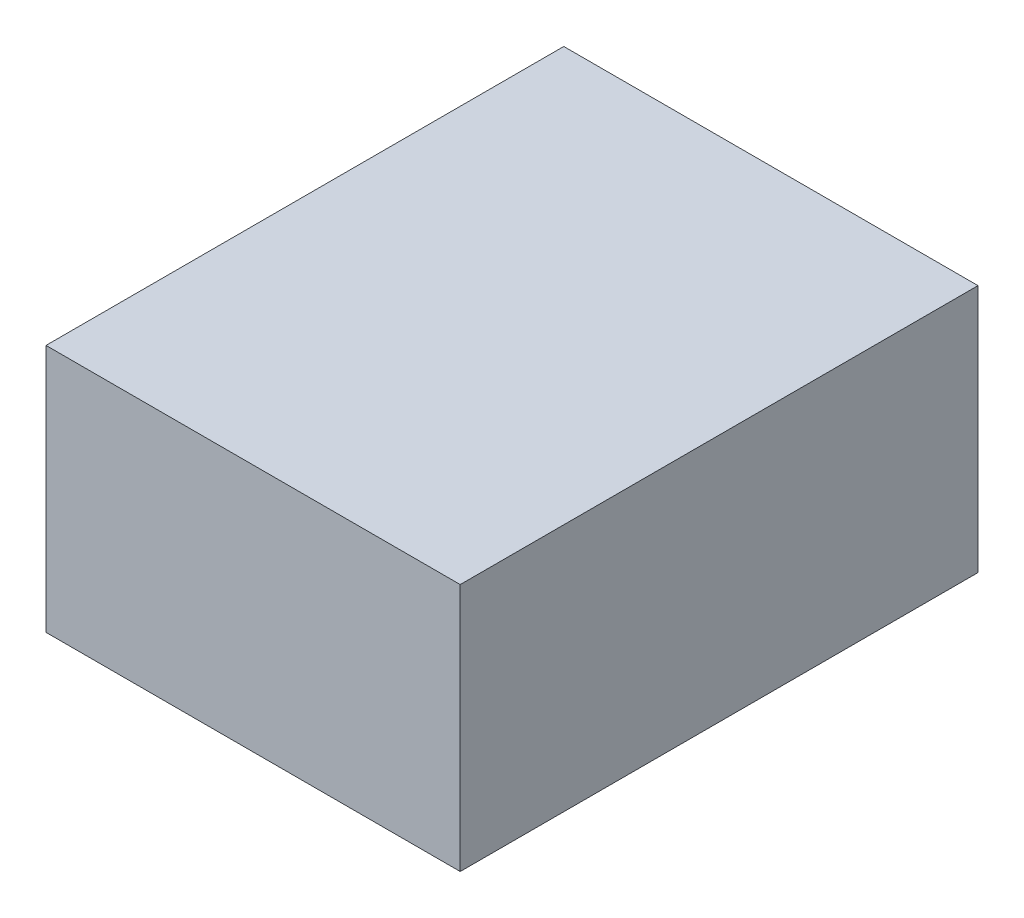
ISO-10303-21;
HEADER;
FILE_DESCRIPTION(('STEP AP214'),'2;1');
FILE_NAME('part.step','',(''),(''),'','','');
FILE_SCHEMA(('AUTOMOTIVE_DESIGN { 1 0 10303 214 1 1 1 1 }'));
ENDSEC;
DATA;
#1=APPLICATION_CONTEXT('core data for automotive mechanical design processes');
#2=APPLICATION_PROTOCOL_DEFINITION('international standard','automotive_design',2000,#1);
#3=PRODUCT_CONTEXT('',#1,'mechanical');
#4=PRODUCT('Part','Part','',(#3));
#5=PRODUCT_RELATED_PRODUCT_CATEGORY('part','',(#4));
#6=PRODUCT_DEFINITION_FORMATION('','',#4);
#7=PRODUCT_DEFINITION_CONTEXT('part definition',#1,'design');
#8=PRODUCT_DEFINITION('design','',#6,#7);
#9=PRODUCT_DEFINITION_SHAPE('','',#8);
#10=(LENGTH_UNIT() NAMED_UNIT(*) SI_UNIT(.MILLI.,.METRE.));
#11=(NAMED_UNIT(*) PLANE_ANGLE_UNIT() SI_UNIT($,.RADIAN.));
#12=(NAMED_UNIT(*) SI_UNIT($,.STERADIAN.) SOLID_ANGLE_UNIT());
#13=UNCERTAINTY_MEASURE_WITH_UNIT(LENGTH_MEASURE(1.E-05),#10,'distance_accuracy_value','');
#14=(GEOMETRIC_REPRESENTATION_CONTEXT(3) GLOBAL_UNCERTAINTY_ASSIGNED_CONTEXT((#13)) GLOBAL_UNIT_ASSIGNED_CONTEXT((#10,
#11,#12)) REPRESENTATION_CONTEXT('',''));
#15=CARTESIAN_POINT('',(0.,0.,0.));
#16=DIRECTION('',(0.,0.,1.));
#17=DIRECTION('',(1.,0.,0.));
#18=AXIS2_PLACEMENT_3D('',#15,#16,#17);
#19=CARTESIAN_POINT('',(1.,1.2,-1.25));
#20=DIRECTION('',(-1.,0.,0.));
#21=DIRECTION('',(0.,0.,1.));
#22=AXIS2_PLACEMENT_3D('',#19,#20,#21);
#23=PLANE('',#22);
#24=DIRECTION('',(0.,0.,-1.));
#25=VECTOR('',#24,1.);
#26=CARTESIAN_POINT('',(1.,0.,-1.25));
#27=LINE('',#26,#25);
#28=CARTESIAN_POINT('',(1.,0.,1.25));
#29=VERTEX_POINT('',#28);
#30=CARTESIAN_POINT('',(1.,0.,-1.25));
#31=VERTEX_POINT('',#30);
#32=EDGE_CURVE('E99',#29,#31,#27,.T.);
#33=ORIENTED_EDGE('',*,*,#32,.T.);
#34=DIRECTION('',(0.,-1.,0.));
#35=VECTOR('',#34,1.);
#36=CARTESIAN_POINT('',(1.,1.2,-1.25));
#37=LINE('',#36,#35);
#38=CARTESIAN_POINT('',(1.,1.2,-1.25));
#39=VERTEX_POINT('',#38);
#40=EDGE_CURVE('E11',#39,#31,#37,.T.);
#41=ORIENTED_EDGE('',*,*,#40,.F.);
#42=DIRECTION('',(0.,0.,-1.));
#43=VECTOR('',#42,1.);
#44=CARTESIAN_POINT('',(1.,1.2,-1.25));
#45=LINE('',#44,#43);
#46=CARTESIAN_POINT('',(1.,1.2,1.25));
#47=VERTEX_POINT('',#46);
#48=EDGE_CURVE('E87',#47,#39,#45,.T.);
#49=ORIENTED_EDGE('',*,*,#48,.F.);
#50=DIRECTION('',(0.,-1.,0.));
#51=VECTOR('',#50,1.);
#52=CARTESIAN_POINT('',(1.,1.2,1.25));
#53=LINE('',#52,#51);
#54=EDGE_CURVE('E95',#47,#29,#53,.T.);
#55=ORIENTED_EDGE('',*,*,#54,.T.);
#56=EDGE_LOOP('',(#33,#41,#49,#55));
#57=FACE_BOUND('',#56,.T.);
#58=ADVANCED_FACE('F36',(#57),#23,.F.);
#59=CARTESIAN_POINT('',(-1.,1.2,-1.25));
#60=DIRECTION('',(0.,0.,1.));
#61=DIRECTION('',(1.,0.,0.));
#62=AXIS2_PLACEMENT_3D('',#59,#60,#61);
#63=PLANE('',#62);
#64=DIRECTION('',(-1.,0.,0.));
#65=VECTOR('',#64,1.);
#66=CARTESIAN_POINT('',(-1.,0.,-1.25));
#67=LINE('',#66,#65);
#68=CARTESIAN_POINT('',(-1.,0.,-1.25));
#69=VERTEX_POINT('',#68);
#70=EDGE_CURVE('E91',#31,#69,#67,.T.);
#71=ORIENTED_EDGE('',*,*,#70,.T.);
#72=DIRECTION('',(0.,-1.,0.));
#73=VECTOR('',#72,1.);
#74=CARTESIAN_POINT('',(-1.,1.2,-1.25));
#75=LINE('',#74,#73);
#76=CARTESIAN_POINT('',(-1.,1.2,-1.25));
#77=VERTEX_POINT('',#76);
#78=EDGE_CURVE('E44',#77,#69,#75,.T.);
#79=ORIENTED_EDGE('',*,*,#78,.F.);
#80=DIRECTION('',(-1.,0.,0.));
#81=VECTOR('',#80,1.);
#82=CARTESIAN_POINT('',(-1.,1.2,-1.25));
#83=LINE('',#82,#81);
#84=EDGE_CURVE('E82',#39,#77,#83,.T.);
#85=ORIENTED_EDGE('',*,*,#84,.F.);
#86=ORIENTED_EDGE('',*,*,#40,.T.);
#87=EDGE_LOOP('',(#71,#79,#85,#86));
#88=FACE_BOUND('',#87,.T.);
#89=ADVANCED_FACE('F90',(#88),#63,.F.);
#90=CARTESIAN_POINT('',(-1.,1.2,-1.25));
#91=DIRECTION('',(1.,0.,0.));
#92=DIRECTION('',(0.,0.,-1.));
#93=AXIS2_PLACEMENT_3D('',#90,#91,#92);
#94=PLANE('',#93);
#95=DIRECTION('',(0.,0.,1.));
#96=VECTOR('',#95,1.);
#97=CARTESIAN_POINT('',(-1.,0.,-1.25));
#98=LINE('',#97,#96);
#99=CARTESIAN_POINT('',(-1.,0.,1.25));
#100=VERTEX_POINT('',#99);
#101=EDGE_CURVE('E69',#69,#100,#98,.T.);
#102=ORIENTED_EDGE('',*,*,#101,.T.);
#103=DIRECTION('',(0.,-1.,0.));
#104=VECTOR('',#103,1.);
#105=CARTESIAN_POINT('',(-1.,1.2,1.25));
#106=LINE('',#105,#104);
#107=CARTESIAN_POINT('',(-1.,1.2,1.25));
#108=VERTEX_POINT('',#107);
#109=EDGE_CURVE('E92',#108,#100,#106,.T.);
#110=ORIENTED_EDGE('',*,*,#109,.F.);
#111=DIRECTION('',(0.,0.,1.));
#112=VECTOR('',#111,1.);
#113=CARTESIAN_POINT('',(-1.,1.2,-1.25));
#114=LINE('',#113,#112);
#115=EDGE_CURVE('E85',#77,#108,#114,.T.);
#116=ORIENTED_EDGE('',*,*,#115,.F.);
#117=ORIENTED_EDGE('',*,*,#78,.T.);
#118=EDGE_LOOP('',(#102,#110,#116,#117));
#119=FACE_BOUND('',#118,.T.);
#120=ADVANCED_FACE('F93',(#119),#94,.F.);
#121=CARTESIAN_POINT('',(-1.,1.2,1.25));
#122=DIRECTION('',(0.,0.,-1.));
#123=DIRECTION('',(-1.,0.,0.));
#124=AXIS2_PLACEMENT_3D('',#121,#122,#123);
#125=PLANE('',#124);
#126=DIRECTION('',(1.,0.,0.));
#127=VECTOR('',#126,1.);
#128=CARTESIAN_POINT('',(-1.,0.,1.25));
#129=LINE('',#128,#127);
#130=EDGE_CURVE('E75',#100,#29,#129,.T.);
#131=ORIENTED_EDGE('',*,*,#130,.T.);
#132=ORIENTED_EDGE('',*,*,#54,.F.);
#133=DIRECTION('',(1.,0.,0.));
#134=VECTOR('',#133,1.);
#135=CARTESIAN_POINT('',(-1.,1.2,1.25));
#136=LINE('',#135,#134);
#137=EDGE_CURVE('E52',#108,#47,#136,.T.);
#138=ORIENTED_EDGE('',*,*,#137,.F.);
#139=ORIENTED_EDGE('',*,*,#109,.T.);
#140=EDGE_LOOP('',(#131,#132,#138,#139));
#141=FACE_BOUND('',#140,.T.);
#142=ADVANCED_FACE('F106',(#141),#125,.F.);
#143=CARTESIAN_POINT('',(0.,1.2,0.));
#144=DIRECTION('',(0.,1.,0.));
#145=DIRECTION('',(0.,0.,1.));
#146=AXIS2_PLACEMENT_3D('',#143,#144,#145);
#147=PLANE('',#146);
#148=ORIENTED_EDGE('',*,*,#48,.T.);
#149=ORIENTED_EDGE('',*,*,#84,.T.);
#150=ORIENTED_EDGE('',*,*,#115,.T.);
#151=ORIENTED_EDGE('',*,*,#137,.T.);
#152=EDGE_LOOP('',(#148,#149,#150,#151));
#153=FACE_BOUND('',#152,.T.);
#154=ADVANCED_FACE('F83',(#153),#147,.T.);
#155=CARTESIAN_POINT('',(0.,0.,0.));
#156=DIRECTION('',(0.,1.,0.));
#157=DIRECTION('',(0.,0.,1.));
#158=AXIS2_PLACEMENT_3D('',#155,#156,#157);
#159=PLANE('',#158);
#160=ORIENTED_EDGE('',*,*,#32,.F.);
#161=ORIENTED_EDGE('',*,*,#130,.F.);
#162=ORIENTED_EDGE('',*,*,#101,.F.);
#163=ORIENTED_EDGE('',*,*,#70,.F.);
#164=EDGE_LOOP('',(#160,#161,#162,#163));
#165=FACE_BOUND('',#164,.T.);
#166=ADVANCED_FACE('F109',(#165),#159,.F.);
#167=CLOSED_SHELL('',(#58,#89,#120,#142,#154,#166));
#168=MANIFOLD_SOLID_BREP('B2',#167);
#169=ADVANCED_BREP_SHAPE_REPRESENTATION('',(#18,#168),#14);
#170=SHAPE_DEFINITION_REPRESENTATION(#9,#169);
ENDSEC;
END-ISO-10303-21;
